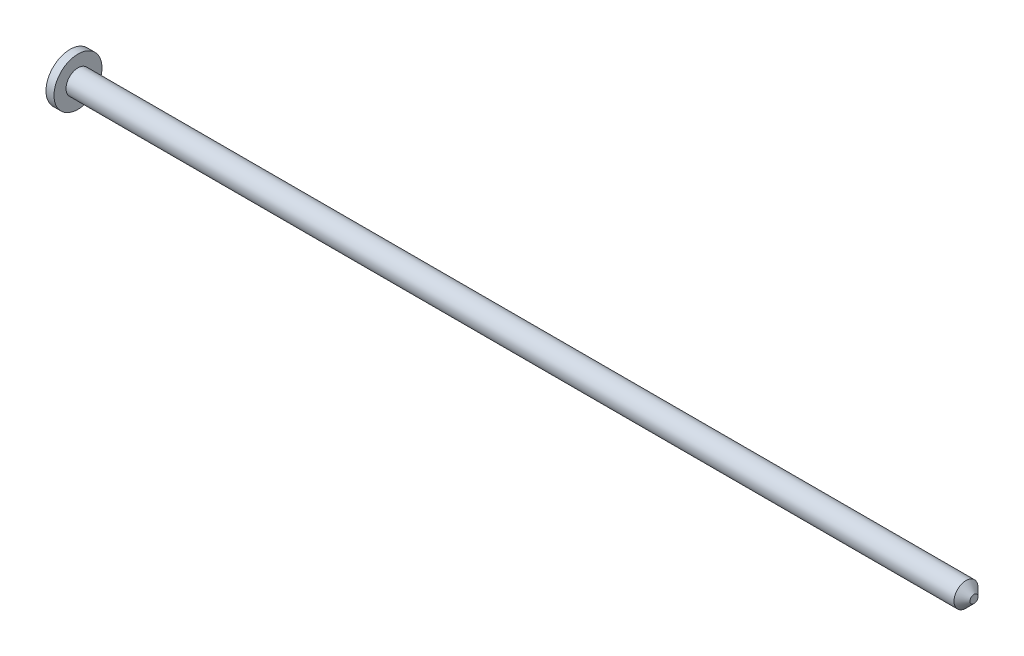
ISO-10303-21;
HEADER;
FILE_DESCRIPTION(('STEP AP214'),'2;1');
FILE_NAME('part.step','',(''),(''),'','','');
FILE_SCHEMA(('AUTOMOTIVE_DESIGN { 1 0 10303 214 1 1 1 1 }'));
ENDSEC;
DATA;
#1=APPLICATION_CONTEXT('core data for automotive mechanical design processes');
#2=APPLICATION_PROTOCOL_DEFINITION('international standard','automotive_design',2000,#1);
#3=PRODUCT_CONTEXT('',#1,'mechanical');
#4=PRODUCT('Part','Part','',(#3));
#5=PRODUCT_RELATED_PRODUCT_CATEGORY('part','',(#4));
#6=PRODUCT_DEFINITION_FORMATION('','',#4);
#7=PRODUCT_DEFINITION_CONTEXT('part definition',#1,'design');
#8=PRODUCT_DEFINITION('design','',#6,#7);
#9=PRODUCT_DEFINITION_SHAPE('','',#8);
#10=(LENGTH_UNIT() NAMED_UNIT(*) SI_UNIT(.MILLI.,.METRE.));
#11=(NAMED_UNIT(*) PLANE_ANGLE_UNIT() SI_UNIT($,.RADIAN.));
#12=(NAMED_UNIT(*) SI_UNIT($,.STERADIAN.) SOLID_ANGLE_UNIT());
#13=UNCERTAINTY_MEASURE_WITH_UNIT(LENGTH_MEASURE(1.E-05),#10,'distance_accuracy_value','');
#14=(GEOMETRIC_REPRESENTATION_CONTEXT(3) GLOBAL_UNCERTAINTY_ASSIGNED_CONTEXT((#13)) GLOBAL_UNIT_ASSIGNED_CONTEXT((#10,
#11,#12)) REPRESENTATION_CONTEXT('',''));
#15=CARTESIAN_POINT('',(0.,0.,0.));
#16=DIRECTION('',(0.,0.,1.));
#17=DIRECTION('',(1.,0.,0.));
#18=AXIS2_PLACEMENT_3D('',#15,#16,#17);
#19=CARTESIAN_POINT('',(0.,3.,0.));
#20=DIRECTION('',(1.,0.,0.));
#21=DIRECTION('',(0.,0.,-1.));
#22=AXIS2_PLACEMENT_3D('',#19,#20,#21);
#23=PLANE('',#22);
#24=CARTESIAN_POINT('',(0.,0.,0.));
#25=DIRECTION('',(-1.,0.,0.));
#26=DIRECTION('',(0.,0.,1.));
#27=AXIS2_PLACEMENT_3D('',#24,#25,#26);
#28=CIRCLE('',#27,3.);
#29=CARTESIAN_POINT('',(0.,0.,3.));
#30=VERTEX_POINT('',#29);
#31=EDGE_CURVE('E55',#30,#30,#28,.T.);
#32=ORIENTED_EDGE('',*,*,#31,.T.);
#33=EDGE_LOOP('',(#32));
#34=FACE_BOUND('',#33,.T.);
#35=ADVANCED_FACE('F35',(#34),#23,.F.);
#36=CARTESIAN_POINT('',(113.,0.,0.));
#37=DIRECTION('',(-1.,0.,0.));
#38=DIRECTION('',(0.,0.,1.));
#39=AXIS2_PLACEMENT_3D('',#36,#37,#38);
#40=PLANE('',#39);
#41=CARTESIAN_POINT('',(113.,0.,0.));
#42=DIRECTION('',(-1.,0.,0.));
#43=DIRECTION('',(0.,0.,1.));
#44=AXIS2_PLACEMENT_3D('',#41,#42,#43);
#45=CIRCLE('',#44,0.500000000000014);
#46=CARTESIAN_POINT('',(113.,0.,0.500000000000014));
#47=VERTEX_POINT('',#46);
#48=EDGE_CURVE('E10',#47,#47,#45,.F.);
#49=ORIENTED_EDGE('',*,*,#48,.T.);
#50=EDGE_LOOP('',(#49));
#51=FACE_BOUND('',#50,.T.);
#52=ADVANCED_FACE('F74',(#51),#40,.F.);
#53=CARTESIAN_POINT('',(0.,0.,0.));
#54=DIRECTION('',(-1.,0.,0.));
#55=DIRECTION('',(0.,0.,1.));
#56=AXIS2_PLACEMENT_3D('',#53,#54,#55);
#57=CYLINDRICAL_SURFACE('',#56,1.49999999999999);
#58=CARTESIAN_POINT('',(112.,0.,0.));
#59=DIRECTION('',(-1.,0.,0.));
#60=DIRECTION('',(0.,0.,1.));
#61=AXIS2_PLACEMENT_3D('',#58,#59,#60);
#62=CIRCLE('',#61,1.49999999999999);
#63=CARTESIAN_POINT('',(112.,0.,1.49999999999999));
#64=VERTEX_POINT('',#63);
#65=EDGE_CURVE('E42',#64,#64,#62,.T.);
#66=ORIENTED_EDGE('',*,*,#65,.T.);
#67=EDGE_LOOP('',(#66));
#68=FACE_BOUND('',#67,.T.);
#69=CARTESIAN_POINT('',(1.00000000000001,0.,0.));
#70=DIRECTION('',(-1.,0.,0.));
#71=DIRECTION('',(0.,0.,1.));
#72=AXIS2_PLACEMENT_3D('',#69,#70,#71);
#73=CIRCLE('',#72,1.49999999999999);
#74=CARTESIAN_POINT('',(1.00000000000001,0.,1.49999999999999));
#75=VERTEX_POINT('',#74);
#76=EDGE_CURVE('E46',#75,#75,#73,.T.);
#77=ORIENTED_EDGE('',*,*,#76,.F.);
#78=EDGE_LOOP('',(#77));
#79=FACE_BOUND('',#78,.T.);
#80=ADVANCED_FACE('F69',(#68,#79),#57,.T.);
#81=CARTESIAN_POINT('',(1.00000000000001,3.,0.));
#82=DIRECTION('',(-1.,0.,0.));
#83=DIRECTION('',(0.,0.,1.));
#84=AXIS2_PLACEMENT_3D('',#81,#82,#83);
#85=PLANE('',#84);
#86=CARTESIAN_POINT('',(1.00000000000001,0.,0.));
#87=DIRECTION('',(-1.,0.,0.));
#88=DIRECTION('',(0.,0.,1.));
#89=AXIS2_PLACEMENT_3D('',#86,#87,#88);
#90=CIRCLE('',#89,3.);
#91=CARTESIAN_POINT('',(1.00000000000001,0.,3.));
#92=VERTEX_POINT('',#91);
#93=EDGE_CURVE('E50',#92,#92,#90,.T.);
#94=ORIENTED_EDGE('',*,*,#93,.F.);
#95=EDGE_LOOP('',(#94));
#96=FACE_BOUND('',#95,.T.);
#97=ORIENTED_EDGE('',*,*,#76,.T.);
#98=EDGE_LOOP('',(#97));
#99=FACE_BOUND('',#98,.T.);
#100=ADVANCED_FACE('F63',(#96,#99),#85,.F.);
#101=CARTESIAN_POINT('',(0.,0.,0.));
#102=DIRECTION('',(-1.,0.,0.));
#103=DIRECTION('',(0.,0.,1.));
#104=AXIS2_PLACEMENT_3D('',#101,#102,#103);
#105=CYLINDRICAL_SURFACE('',#104,3.);
#106=ORIENTED_EDGE('',*,*,#31,.F.);
#107=EDGE_LOOP('',(#106));
#108=FACE_BOUND('',#107,.T.);
#109=ORIENTED_EDGE('',*,*,#93,.T.);
#110=EDGE_LOOP('',(#109));
#111=FACE_BOUND('',#110,.T.);
#112=ADVANCED_FACE('F60',(#108,#111),#105,.T.);
#113=CARTESIAN_POINT('',(112.,0.,0.));
#114=DIRECTION('',(-1.,0.,0.));
#115=DIRECTION('',(0.,0.,1.));
#116=AXIS2_PLACEMENT_3D('',#113,#114,#115);
#117=CONICAL_SURFACE('',#116,1.49999999999999,0.785398163397445);
#118=ORIENTED_EDGE('',*,*,#48,.F.);
#119=EDGE_LOOP('',(#118));
#120=FACE_BOUND('',#119,.T.);
#121=ORIENTED_EDGE('',*,*,#65,.F.);
#122=EDGE_LOOP('',(#121));
#123=FACE_BOUND('',#122,.T.);
#124=ADVANCED_FACE('F37',(#120,#123),#117,.T.);
#125=CLOSED_SHELL('',(#35,#52,#80,#100,#112,#124));
#126=MANIFOLD_SOLID_BREP('B2',#125);
#127=ADVANCED_BREP_SHAPE_REPRESENTATION('',(#18,#126),#14);
#128=SHAPE_DEFINITION_REPRESENTATION(#9,#127);
ENDSEC;
END-ISO-10303-21;
